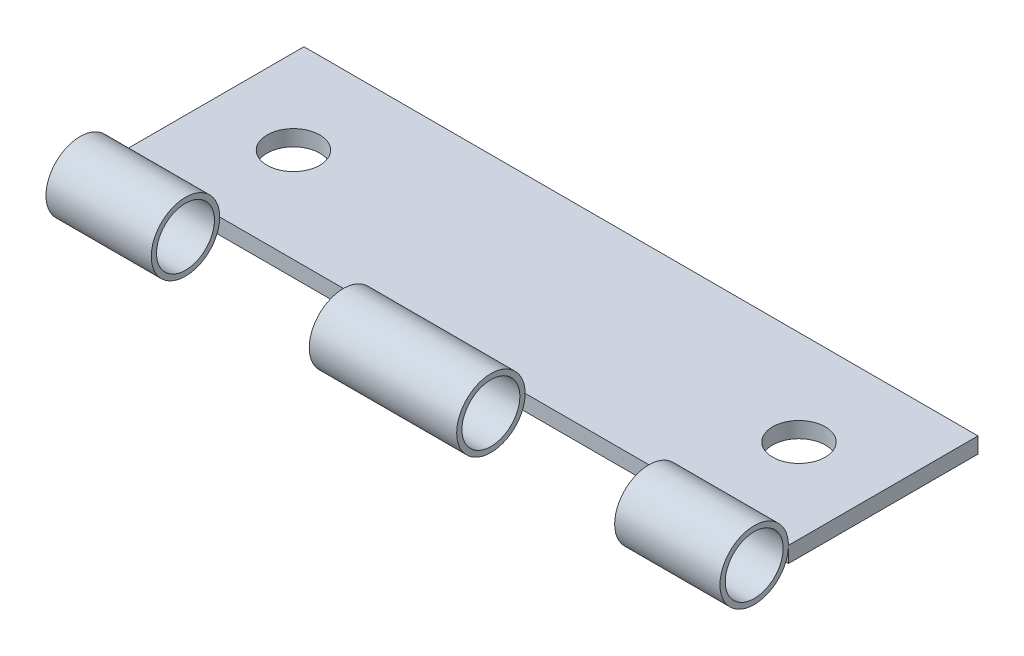
ISO-10303-21;
HEADER;
FILE_DESCRIPTION(('STEP AP214'),'2;1');
FILE_NAME('part.step','',(''),(''),'','','');
FILE_SCHEMA(('AUTOMOTIVE_DESIGN { 1 0 10303 214 1 1 1 1 }'));
ENDSEC;
DATA;
#1=APPLICATION_CONTEXT('core data for automotive mechanical design processes');
#2=APPLICATION_PROTOCOL_DEFINITION('international standard','automotive_design',2000,#1);
#3=PRODUCT_CONTEXT('',#1,'mechanical');
#4=PRODUCT('Part','Part','',(#3));
#5=PRODUCT_RELATED_PRODUCT_CATEGORY('part','',(#4));
#6=PRODUCT_DEFINITION_FORMATION('','',#4);
#7=PRODUCT_DEFINITION_CONTEXT('part definition',#1,'design');
#8=PRODUCT_DEFINITION('design','',#6,#7);
#9=PRODUCT_DEFINITION_SHAPE('','',#8);
#10=(LENGTH_UNIT() NAMED_UNIT(*) SI_UNIT(.MILLI.,.METRE.));
#11=(NAMED_UNIT(*) PLANE_ANGLE_UNIT() SI_UNIT($,.RADIAN.));
#12=(NAMED_UNIT(*) SI_UNIT($,.STERADIAN.) SOLID_ANGLE_UNIT());
#13=UNCERTAINTY_MEASURE_WITH_UNIT(LENGTH_MEASURE(1.E-05),#10,'distance_accuracy_value','');
#14=(GEOMETRIC_REPRESENTATION_CONTEXT(3) GLOBAL_UNCERTAINTY_ASSIGNED_CONTEXT((#13)) GLOBAL_UNIT_ASSIGNED_CONTEXT((#10,
#11,#12)) REPRESENTATION_CONTEXT('',''));
#15=CARTESIAN_POINT('',(0.,0.,0.));
#16=DIRECTION('',(0.,0.,1.));
#17=DIRECTION('',(1.,0.,0.));
#18=AXIS2_PLACEMENT_3D('',#15,#16,#17);
#19=CARTESIAN_POINT('',(32.,1.5,12.25));
#20=DIRECTION('',(-1.,0.,0.));
#21=DIRECTION('',(0.,0.,1.));
#22=AXIS2_PLACEMENT_3D('',#19,#20,#21);
#23=CYLINDRICAL_SURFACE('',#22,3.25);
#24=CARTESIAN_POINT('',(-32.,1.5,12.25));
#25=DIRECTION('',(1.,0.,0.));
#26=DIRECTION('',(0.,0.,-1.));
#27=AXIS2_PLACEMENT_3D('',#24,#25,#26);
#28=CIRCLE('',#27,3.25);
#29=CARTESIAN_POINT('',(-32.,1.5,9.));
#30=VERTEX_POINT('',#29);
#31=EDGE_CURVE('E46',#30,#30,#28,.T.);
#32=ORIENTED_EDGE('',*,*,#31,.T.);
#33=EDGE_LOOP('',(#32));
#34=FACE_BOUND('',#33,.T.);
#35=CARTESIAN_POINT('',(-22.,1.5,12.25));
#36=DIRECTION('',(1.,0.,0.));
#37=DIRECTION('',(0.,0.,-1.));
#38=AXIS2_PLACEMENT_3D('',#35,#36,#37);
#39=CIRCLE('',#38,3.25);
#40=CARTESIAN_POINT('',(-22.,1.5,9.));
#41=VERTEX_POINT('',#40);
#42=EDGE_CURVE('E11',#41,#41,#39,.T.);
#43=ORIENTED_EDGE('',*,*,#42,.F.);
#44=EDGE_LOOP('',(#43));
#45=FACE_BOUND('',#44,.T.);
#46=ADVANCED_FACE('F39',(#34,#45),#23,.T.);
#47=CARTESIAN_POINT('',(-32.,1.5,12.25));
#48=DIRECTION('',(1.,0.,0.));
#49=DIRECTION('',(0.,0.,-1.));
#50=AXIS2_PLACEMENT_3D('',#47,#48,#49);
#51=PLANE('',#50);
#52=CARTESIAN_POINT('',(-32.,1.5,12.25));
#53=DIRECTION('',(1.,0.,0.));
#54=DIRECTION('',(0.,0.,-1.));
#55=AXIS2_PLACEMENT_3D('',#52,#53,#54);
#56=CIRCLE('',#55,2.75);
#57=CARTESIAN_POINT('',(-32.,1.5,9.49999999999999));
#58=VERTEX_POINT('',#57);
#59=EDGE_CURVE('E52',#58,#58,#56,.T.);
#60=ORIENTED_EDGE('',*,*,#59,.T.);
#61=EDGE_LOOP('',(#60));
#62=FACE_BOUND('',#61,.T.);
#63=ORIENTED_EDGE('',*,*,#31,.F.);
#64=EDGE_LOOP('',(#63));
#65=FACE_BOUND('',#64,.T.);
#66=ADVANCED_FACE('F64',(#62,#65),#51,.F.);
#67=CARTESIAN_POINT('',(-22.,44.,9.));
#68=DIRECTION('',(1.,0.,0.));
#69=DIRECTION('',(0.,0.,-1.));
#70=AXIS2_PLACEMENT_3D('',#67,#68,#69);
#71=PLANE('',#70);
#72=CARTESIAN_POINT('',(-22.,1.5,12.25));
#73=DIRECTION('',(1.,0.,0.));
#74=DIRECTION('',(0.,0.,-1.));
#75=AXIS2_PLACEMENT_3D('',#72,#73,#74);
#76=CIRCLE('',#75,2.75);
#77=CARTESIAN_POINT('',(-22.,1.5,9.49999999999999));
#78=VERTEX_POINT('',#77);
#79=EDGE_CURVE('E42',#78,#78,#76,.T.);
#80=ORIENTED_EDGE('',*,*,#79,.F.);
#81=EDGE_LOOP('',(#80));
#82=FACE_BOUND('',#81,.T.);
#83=ORIENTED_EDGE('',*,*,#42,.T.);
#84=EDGE_LOOP('',(#83));
#85=FACE_BOUND('',#84,.T.);
#86=ADVANCED_FACE('F62',(#82,#85),#71,.T.);
#87=CARTESIAN_POINT('',(-32.,1.5,12.25));
#88=DIRECTION('',(1.,0.,0.));
#89=DIRECTION('',(0.,0.,-1.));
#90=AXIS2_PLACEMENT_3D('',#87,#88,#89);
#91=CYLINDRICAL_SURFACE('',#90,2.75);
#92=ORIENTED_EDGE('',*,*,#79,.T.);
#93=EDGE_LOOP('',(#92));
#94=FACE_BOUND('',#93,.T.);
#95=ORIENTED_EDGE('',*,*,#59,.F.);
#96=EDGE_LOOP('',(#95));
#97=FACE_BOUND('',#96,.T.);
#98=ADVANCED_FACE('F59',(#94,#97),#91,.F.);
#99=CLOSED_SHELL('',(#46,#66,#86,#98));
#100=MANIFOLD_SOLID_BREP('B2',#99);
#101=CARTESIAN_POINT('',(32.,1.5,12.25));
#102=DIRECTION('',(1.,0.,0.));
#103=DIRECTION('',(0.,0.,-1.));
#104=AXIS2_PLACEMENT_3D('',#101,#102,#103);
#105=PLANE('',#104);
#106=CARTESIAN_POINT('',(32.,1.5,12.25));
#107=DIRECTION('',(1.,0.,0.));
#108=DIRECTION('',(0.,0.,-1.));
#109=AXIS2_PLACEMENT_3D('',#106,#107,#108);
#110=CIRCLE('',#109,2.75);
#111=CARTESIAN_POINT('',(32.,1.5,9.49999999999999));
#112=VERTEX_POINT('',#111);
#113=EDGE_CURVE('E122',#112,#112,#110,.T.);
#114=ORIENTED_EDGE('',*,*,#113,.F.);
#115=EDGE_LOOP('',(#114));
#116=FACE_BOUND('',#115,.T.);
#117=CARTESIAN_POINT('',(32.,1.5,12.25));
#118=DIRECTION('',(1.,0.,0.));
#119=DIRECTION('',(0.,0.,-1.));
#120=AXIS2_PLACEMENT_3D('',#117,#118,#119);
#121=CIRCLE('',#120,3.25);
#122=CARTESIAN_POINT('',(32.,1.5,9.));
#123=VERTEX_POINT('',#122);
#124=EDGE_CURVE('E116',#123,#123,#121,.T.);
#125=ORIENTED_EDGE('',*,*,#124,.T.);
#126=EDGE_LOOP('',(#125));
#127=FACE_BOUND('',#126,.T.);
#128=ADVANCED_FACE('F108',(#116,#127),#105,.T.);
#129=CARTESIAN_POINT('',(32.,1.5,12.25));
#130=DIRECTION('',(-1.,0.,0.));
#131=DIRECTION('',(0.,0.,1.));
#132=AXIS2_PLACEMENT_3D('',#129,#130,#131);
#133=CYLINDRICAL_SURFACE('',#132,3.25);
#134=ORIENTED_EDGE('',*,*,#124,.F.);
#135=EDGE_LOOP('',(#134));
#136=FACE_BOUND('',#135,.T.);
#137=CARTESIAN_POINT('',(22.,1.5,12.25));
#138=DIRECTION('',(-1.,0.,0.));
#139=DIRECTION('',(0.,0.,1.));
#140=AXIS2_PLACEMENT_3D('',#137,#138,#139);
#141=CIRCLE('',#140,3.25);
#142=CARTESIAN_POINT('',(22.,1.5,15.5));
#143=VERTEX_POINT('',#142);
#144=EDGE_CURVE('E38',#143,#143,#141,.T.);
#145=ORIENTED_EDGE('',*,*,#144,.F.);
#146=EDGE_LOOP('',(#145));
#147=FACE_BOUND('',#146,.T.);
#148=ADVANCED_FACE('F110',(#136,#147),#133,.T.);
#149=CARTESIAN_POINT('',(22.,44.,9.));
#150=DIRECTION('',(-1.,0.,0.));
#151=DIRECTION('',(0.,0.,1.));
#152=AXIS2_PLACEMENT_3D('',#149,#150,#151);
#153=PLANE('',#152);
#154=CARTESIAN_POINT('',(22.,1.5,12.25));
#155=DIRECTION('',(-1.,0.,0.));
#156=DIRECTION('',(0.,0.,1.));
#157=AXIS2_PLACEMENT_3D('',#154,#155,#156);
#158=CIRCLE('',#157,2.75);
#159=CARTESIAN_POINT('',(22.,1.5,15.));
#160=VERTEX_POINT('',#159);
#161=EDGE_CURVE('E112',#160,#160,#158,.T.);
#162=ORIENTED_EDGE('',*,*,#161,.F.);
#163=EDGE_LOOP('',(#162));
#164=FACE_BOUND('',#163,.T.);
#165=ORIENTED_EDGE('',*,*,#144,.T.);
#166=EDGE_LOOP('',(#165));
#167=FACE_BOUND('',#166,.T.);
#168=ADVANCED_FACE('F131',(#164,#167),#153,.T.);
#169=CARTESIAN_POINT('',(-32.,1.5,12.25));
#170=DIRECTION('',(1.,0.,0.));
#171=DIRECTION('',(0.,0.,-1.));
#172=AXIS2_PLACEMENT_3D('',#169,#170,#171);
#173=CYLINDRICAL_SURFACE('',#172,2.75);
#174=ORIENTED_EDGE('',*,*,#161,.T.);
#175=EDGE_LOOP('',(#174));
#176=FACE_BOUND('',#175,.T.);
#177=ORIENTED_EDGE('',*,*,#113,.T.);
#178=EDGE_LOOP('',(#177));
#179=FACE_BOUND('',#178,.T.);
#180=ADVANCED_FACE('F129',(#176,#179),#173,.F.);
#181=CLOSED_SHELL('',(#128,#148,#168,#180));
#182=MANIFOLD_SOLID_BREP('B6',#181);
#183=CARTESIAN_POINT('',(32.,1.5,12.25));
#184=DIRECTION('',(-1.,0.,0.));
#185=DIRECTION('',(0.,0.,1.));
#186=AXIS2_PLACEMENT_3D('',#183,#184,#185);
#187=CYLINDRICAL_SURFACE('',#186,3.25);
#188=CARTESIAN_POINT('',(7.,1.5,12.25));
#189=DIRECTION('',(1.,0.,0.));
#190=DIRECTION('',(0.,0.,-1.));
#191=AXIS2_PLACEMENT_3D('',#188,#189,#190);
#192=CIRCLE('',#191,3.25);
#193=CARTESIAN_POINT('',(7.,1.5,9.));
#194=VERTEX_POINT('',#193);
#195=EDGE_CURVE('E185',#194,#194,#192,.T.);
#196=ORIENTED_EDGE('',*,*,#195,.F.);
#197=EDGE_LOOP('',(#196));
#198=FACE_BOUND('',#197,.T.);
#199=CARTESIAN_POINT('',(-7.,1.5,12.25));
#200=DIRECTION('',(-1.,0.,0.));
#201=DIRECTION('',(0.,0.,1.));
#202=AXIS2_PLACEMENT_3D('',#199,#200,#201);
#203=CIRCLE('',#202,3.25);
#204=CARTESIAN_POINT('',(-7.,1.5,15.5));
#205=VERTEX_POINT('',#204);
#206=EDGE_CURVE('E107',#205,#205,#203,.T.);
#207=ORIENTED_EDGE('',*,*,#206,.F.);
#208=EDGE_LOOP('',(#207));
#209=FACE_BOUND('',#208,.T.);
#210=ADVANCED_FACE('F178',(#198,#209),#187,.T.);
#211=CARTESIAN_POINT('',(7.,44.,9.));
#212=DIRECTION('',(1.,0.,0.));
#213=DIRECTION('',(0.,0.,-1.));
#214=AXIS2_PLACEMENT_3D('',#211,#212,#213);
#215=PLANE('',#214);
#216=CARTESIAN_POINT('',(7.,1.5,12.25));
#217=DIRECTION('',(1.,0.,0.));
#218=DIRECTION('',(0.,0.,-1.));
#219=AXIS2_PLACEMENT_3D('',#216,#217,#218);
#220=CIRCLE('',#219,2.75);
#221=CARTESIAN_POINT('',(7.,1.5,9.49999999999999));
#222=VERTEX_POINT('',#221);
#223=EDGE_CURVE('E189',#222,#222,#220,.T.);
#224=ORIENTED_EDGE('',*,*,#223,.F.);
#225=EDGE_LOOP('',(#224));
#226=FACE_BOUND('',#225,.T.);
#227=ORIENTED_EDGE('',*,*,#195,.T.);
#228=EDGE_LOOP('',(#227));
#229=FACE_BOUND('',#228,.T.);
#230=ADVANCED_FACE('F202',(#226,#229),#215,.T.);
#231=CARTESIAN_POINT('',(-7.,44.,9.));
#232=DIRECTION('',(-1.,0.,0.));
#233=DIRECTION('',(0.,0.,1.));
#234=AXIS2_PLACEMENT_3D('',#231,#232,#233);
#235=PLANE('',#234);
#236=CARTESIAN_POINT('',(-7.,1.5,12.25));
#237=DIRECTION('',(-1.,0.,0.));
#238=DIRECTION('',(0.,0.,1.));
#239=AXIS2_PLACEMENT_3D('',#236,#237,#238);
#240=CIRCLE('',#239,2.75);
#241=CARTESIAN_POINT('',(-7.,1.5,15.));
#242=VERTEX_POINT('',#241);
#243=EDGE_CURVE('E181',#242,#242,#240,.T.);
#244=ORIENTED_EDGE('',*,*,#243,.F.);
#245=EDGE_LOOP('',(#244));
#246=FACE_BOUND('',#245,.T.);
#247=ORIENTED_EDGE('',*,*,#206,.T.);
#248=EDGE_LOOP('',(#247));
#249=FACE_BOUND('',#248,.T.);
#250=ADVANCED_FACE('F200',(#246,#249),#235,.T.);
#251=CARTESIAN_POINT('',(-32.,1.5,12.25));
#252=DIRECTION('',(1.,0.,0.));
#253=DIRECTION('',(0.,0.,-1.));
#254=AXIS2_PLACEMENT_3D('',#251,#252,#253);
#255=CYLINDRICAL_SURFACE('',#254,2.75);
#256=ORIENTED_EDGE('',*,*,#223,.T.);
#257=EDGE_LOOP('',(#256));
#258=FACE_BOUND('',#257,.T.);
#259=ORIENTED_EDGE('',*,*,#243,.T.);
#260=EDGE_LOOP('',(#259));
#261=FACE_BOUND('',#260,.T.);
#262=ADVANCED_FACE('F198',(#258,#261),#255,.F.);
#263=CLOSED_SHELL('',(#210,#230,#250,#262));
#264=MANIFOLD_SOLID_BREP('B33',#263);
#265=CARTESIAN_POINT('',(32.,1.5,-9.));
#266=DIRECTION('',(-1.,0.,0.));
#267=DIRECTION('',(0.,0.,1.));
#268=AXIS2_PLACEMENT_3D('',#265,#266,#267);
#269=PLANE('',#268);
#270=DIRECTION('',(0.,0.,-1.));
#271=VECTOR('',#270,1.);
#272=CARTESIAN_POINT('',(32.,0.,-9.));
#273=LINE('',#272,#271);
#274=CARTESIAN_POINT('',(32.,0.,9.));
#275=VERTEX_POINT('',#274);
#276=CARTESIAN_POINT('',(32.,0.,-9.));
#277=VERTEX_POINT('',#276);
#278=EDGE_CURVE('E305',#275,#277,#273,.T.);
#279=ORIENTED_EDGE('',*,*,#278,.T.);
#280=DIRECTION('',(0.,-1.,0.));
#281=VECTOR('',#280,1.);
#282=CARTESIAN_POINT('',(32.,1.5,-9.));
#283=LINE('',#282,#281);
#284=CARTESIAN_POINT('',(32.,1.5,-9.));
#285=VERTEX_POINT('',#284);
#286=EDGE_CURVE('E176',#285,#277,#283,.T.);
#287=ORIENTED_EDGE('',*,*,#286,.F.);
#288=DIRECTION('',(0.,0.,-1.));
#289=VECTOR('',#288,1.);
#290=CARTESIAN_POINT('',(32.,1.5,-9.));
#291=LINE('',#290,#289);
#292=CARTESIAN_POINT('',(32.,1.5,9.));
#293=VERTEX_POINT('',#292);
#294=EDGE_CURVE('E292',#293,#285,#291,.T.);
#295=ORIENTED_EDGE('',*,*,#294,.F.);
#296=DIRECTION('',(0.,-1.,0.));
#297=VECTOR('',#296,1.);
#298=CARTESIAN_POINT('',(32.,1.5,9.));
#299=LINE('',#298,#297);
#300=EDGE_CURVE('E301',#293,#275,#299,.T.);
#301=ORIENTED_EDGE('',*,*,#300,.T.);
#302=EDGE_LOOP('',(#279,#287,#295,#301));
#303=FACE_BOUND('',#302,.T.);
#304=ADVANCED_FACE('F239',(#303),#269,.F.);
#305=CARTESIAN_POINT('',(-32.,1.5,-9.));
#306=DIRECTION('',(0.,0.,1.));
#307=DIRECTION('',(1.,0.,0.));
#308=AXIS2_PLACEMENT_3D('',#305,#306,#307);
#309=PLANE('',#308);
#310=DIRECTION('',(-1.,0.,0.));
#311=VECTOR('',#310,1.);
#312=CARTESIAN_POINT('',(-32.,0.,-9.));
#313=LINE('',#312,#311);
#314=CARTESIAN_POINT('',(-32.,0.,-9.));
#315=VERTEX_POINT('',#314);
#316=EDGE_CURVE('E296',#277,#315,#313,.T.);
#317=ORIENTED_EDGE('',*,*,#316,.T.);
#318=DIRECTION('',(0.,-1.,0.));
#319=VECTOR('',#318,1.);
#320=CARTESIAN_POINT('',(-32.,1.5,-9.));
#321=LINE('',#320,#319);
#322=CARTESIAN_POINT('',(-32.,1.5,-9.));
#323=VERTEX_POINT('',#322);
#324=EDGE_CURVE('E248',#323,#315,#321,.T.);
#325=ORIENTED_EDGE('',*,*,#324,.F.);
#326=DIRECTION('',(-1.,0.,0.));
#327=VECTOR('',#326,1.);
#328=CARTESIAN_POINT('',(-32.,1.5,-9.));
#329=LINE('',#328,#327);
#330=EDGE_CURVE('E287',#285,#323,#329,.T.);
#331=ORIENTED_EDGE('',*,*,#330,.F.);
#332=ORIENTED_EDGE('',*,*,#286,.T.);
#333=EDGE_LOOP('',(#317,#325,#331,#332));
#334=FACE_BOUND('',#333,.T.);
#335=ADVANCED_FACE('F295',(#334),#309,.F.);
#336=CARTESIAN_POINT('',(-32.,1.5,-9.));
#337=DIRECTION('',(1.,0.,0.));
#338=DIRECTION('',(0.,0.,-1.));
#339=AXIS2_PLACEMENT_3D('',#336,#337,#338);
#340=PLANE('',#339);
#341=DIRECTION('',(0.,0.,1.));
#342=VECTOR('',#341,1.);
#343=CARTESIAN_POINT('',(-32.,0.,-9.));
#344=LINE('',#343,#342);
#345=CARTESIAN_POINT('',(-32.,0.,9.));
#346=VERTEX_POINT('',#345);
#347=EDGE_CURVE('E274',#315,#346,#344,.T.);
#348=ORIENTED_EDGE('',*,*,#347,.T.);
#349=DIRECTION('',(0.,-1.,0.));
#350=VECTOR('',#349,1.);
#351=CARTESIAN_POINT('',(-32.,1.5,9.));
#352=LINE('',#351,#350);
#353=CARTESIAN_POINT('',(-32.,1.5,9.));
#354=VERTEX_POINT('',#353);
#355=EDGE_CURVE('E297',#354,#346,#352,.T.);
#356=ORIENTED_EDGE('',*,*,#355,.F.);
#357=DIRECTION('',(0.,0.,1.));
#358=VECTOR('',#357,1.);
#359=CARTESIAN_POINT('',(-32.,1.5,-9.));
#360=LINE('',#359,#358);
#361=EDGE_CURVE('E290',#323,#354,#360,.T.);
#362=ORIENTED_EDGE('',*,*,#361,.F.);
#363=ORIENTED_EDGE('',*,*,#324,.T.);
#364=EDGE_LOOP('',(#348,#356,#362,#363));
#365=FACE_BOUND('',#364,.T.);
#366=ADVANCED_FACE('F299',(#365),#340,.F.);
#367=CARTESIAN_POINT('',(-32.,1.5,9.));
#368=DIRECTION('',(0.,0.,-1.));
#369=DIRECTION('',(-1.,0.,0.));
#370=AXIS2_PLACEMENT_3D('',#367,#368,#369);
#371=PLANE('',#370);
#372=ORIENTED_EDGE('',*,*,#300,.F.);
#373=DIRECTION('',(1.,0.,0.));
#374=VECTOR('',#373,1.);
#375=CARTESIAN_POINT('',(-32.,1.5,9.));
#376=LINE('',#375,#374);
#377=EDGE_CURVE('E257',#354,#293,#376,.T.);
#378=ORIENTED_EDGE('',*,*,#377,.F.);
#379=ORIENTED_EDGE('',*,*,#355,.T.);
#380=DIRECTION('',(1.,0.,0.));
#381=VECTOR('',#380,1.);
#382=CARTESIAN_POINT('',(-32.,0.,9.));
#383=LINE('',#382,#381);
#384=EDGE_CURVE('E280',#346,#275,#383,.T.);
#385=ORIENTED_EDGE('',*,*,#384,.T.);
#386=EDGE_LOOP('',(#372,#378,#379,#385));
#387=FACE_BOUND('',#386,.T.);
#388=ADVANCED_FACE('F332',(#387),#371,.F.);
#389=CARTESIAN_POINT('',(0.,1.5,0.));
#390=DIRECTION('',(0.,1.,0.));
#391=DIRECTION('',(0.,0.,1.));
#392=AXIS2_PLACEMENT_3D('',#389,#390,#391);
#393=PLANE('',#392);
#394=CARTESIAN_POINT('',(-24.,1.5,0.));
#395=DIRECTION('',(0.,1.,0.));
#396=DIRECTION('',(0.,0.,1.));
#397=AXIS2_PLACEMENT_3D('',#394,#395,#396);
#398=CIRCLE('',#397,2.5);
#399=CARTESIAN_POINT('',(-24.,1.5,2.5));
#400=VERTEX_POINT('',#399);
#401=EDGE_CURVE('E314',#400,#400,#398,.T.);
#402=ORIENTED_EDGE('',*,*,#401,.F.);
#403=EDGE_LOOP('',(#402));
#404=FACE_BOUND('',#403,.T.);
#405=CARTESIAN_POINT('',(24.,1.5,0.));
#406=DIRECTION('',(0.,1.,0.));
#407=DIRECTION('',(0.,0.,1.));
#408=AXIS2_PLACEMENT_3D('',#405,#406,#407);
#409=CIRCLE('',#408,2.5);
#410=CARTESIAN_POINT('',(24.,1.5,2.5));
#411=VERTEX_POINT('',#410);
#412=EDGE_CURVE('E319',#411,#411,#409,.T.);
#413=ORIENTED_EDGE('',*,*,#412,.F.);
#414=EDGE_LOOP('',(#413));
#415=FACE_BOUND('',#414,.T.);
#416=ORIENTED_EDGE('',*,*,#294,.T.);
#417=ORIENTED_EDGE('',*,*,#330,.T.);
#418=ORIENTED_EDGE('',*,*,#361,.T.);
#419=ORIENTED_EDGE('',*,*,#377,.T.);
#420=EDGE_LOOP('',(#416,#417,#418,#419));
#421=FACE_BOUND('',#420,.T.);
#422=ADVANCED_FACE('F288',(#404,#415,#421),#393,.T.);
#423=CARTESIAN_POINT('',(0.,0.,0.));
#424=DIRECTION('',(0.,1.,0.));
#425=DIRECTION('',(0.,0.,1.));
#426=AXIS2_PLACEMENT_3D('',#423,#424,#425);
#427=PLANE('',#426);
#428=CARTESIAN_POINT('',(-24.,0.,0.));
#429=DIRECTION('',(0.,1.,0.));
#430=DIRECTION('',(0.,0.,1.));
#431=AXIS2_PLACEMENT_3D('',#428,#429,#430);
#432=CIRCLE('',#431,2.5);
#433=CARTESIAN_POINT('',(-24.,0.,2.5));
#434=VERTEX_POINT('',#433);
#435=EDGE_CURVE('E242',#434,#434,#432,.T.);
#436=ORIENTED_EDGE('',*,*,#435,.T.);
#437=EDGE_LOOP('',(#436));
#438=FACE_BOUND('',#437,.T.);
#439=CARTESIAN_POINT('',(24.,0.,0.));
#440=DIRECTION('',(0.,1.,0.));
#441=DIRECTION('',(0.,0.,1.));
#442=AXIS2_PLACEMENT_3D('',#439,#440,#441);
#443=CIRCLE('',#442,2.5);
#444=CARTESIAN_POINT('',(24.,0.,2.5));
#445=VERTEX_POINT('',#444);
#446=EDGE_CURVE('E312',#445,#445,#443,.T.);
#447=ORIENTED_EDGE('',*,*,#446,.T.);
#448=EDGE_LOOP('',(#447));
#449=FACE_BOUND('',#448,.T.);
#450=ORIENTED_EDGE('',*,*,#278,.F.);
#451=ORIENTED_EDGE('',*,*,#384,.F.);
#452=ORIENTED_EDGE('',*,*,#347,.F.);
#453=ORIENTED_EDGE('',*,*,#316,.F.);
#454=EDGE_LOOP('',(#450,#451,#452,#453));
#455=FACE_BOUND('',#454,.T.);
#456=ADVANCED_FACE('F331',(#438,#449,#455),#427,.F.);
#457=CARTESIAN_POINT('',(24.,-8.5,0.));
#458=DIRECTION('',(0.,1.,0.));
#459=DIRECTION('',(0.,0.,1.));
#460=AXIS2_PLACEMENT_3D('',#457,#458,#459);
#461=CYLINDRICAL_SURFACE('',#460,2.5);
#462=ORIENTED_EDGE('',*,*,#412,.T.);
#463=EDGE_LOOP('',(#462));
#464=FACE_BOUND('',#463,.T.);
#465=ORIENTED_EDGE('',*,*,#446,.F.);
#466=EDGE_LOOP('',(#465));
#467=FACE_BOUND('',#466,.T.);
#468=ADVANCED_FACE('F327',(#464,#467),#461,.F.);
#469=CARTESIAN_POINT('',(-24.,-8.5,0.));
#470=DIRECTION('',(0.,1.,0.));
#471=DIRECTION('',(0.,0.,1.));
#472=AXIS2_PLACEMENT_3D('',#469,#470,#471);
#473=CYLINDRICAL_SURFACE('',#472,2.5);
#474=ORIENTED_EDGE('',*,*,#401,.T.);
#475=EDGE_LOOP('',(#474));
#476=FACE_BOUND('',#475,.T.);
#477=ORIENTED_EDGE('',*,*,#435,.F.);
#478=EDGE_LOOP('',(#477));
#479=FACE_BOUND('',#478,.T.);
#480=ADVANCED_FACE('F367',(#476,#479),#473,.F.);
#481=CLOSED_SHELL('',(#304,#335,#366,#388,#422,#456,#468,#480));
#482=MANIFOLD_SOLID_BREP('B102',#481);
#483=ADVANCED_BREP_SHAPE_REPRESENTATION('',(#18,#100,#182,#264,#482),#14);
#484=SHAPE_DEFINITION_REPRESENTATION(#9,#483);
ENDSEC;
END-ISO-10303-21;
